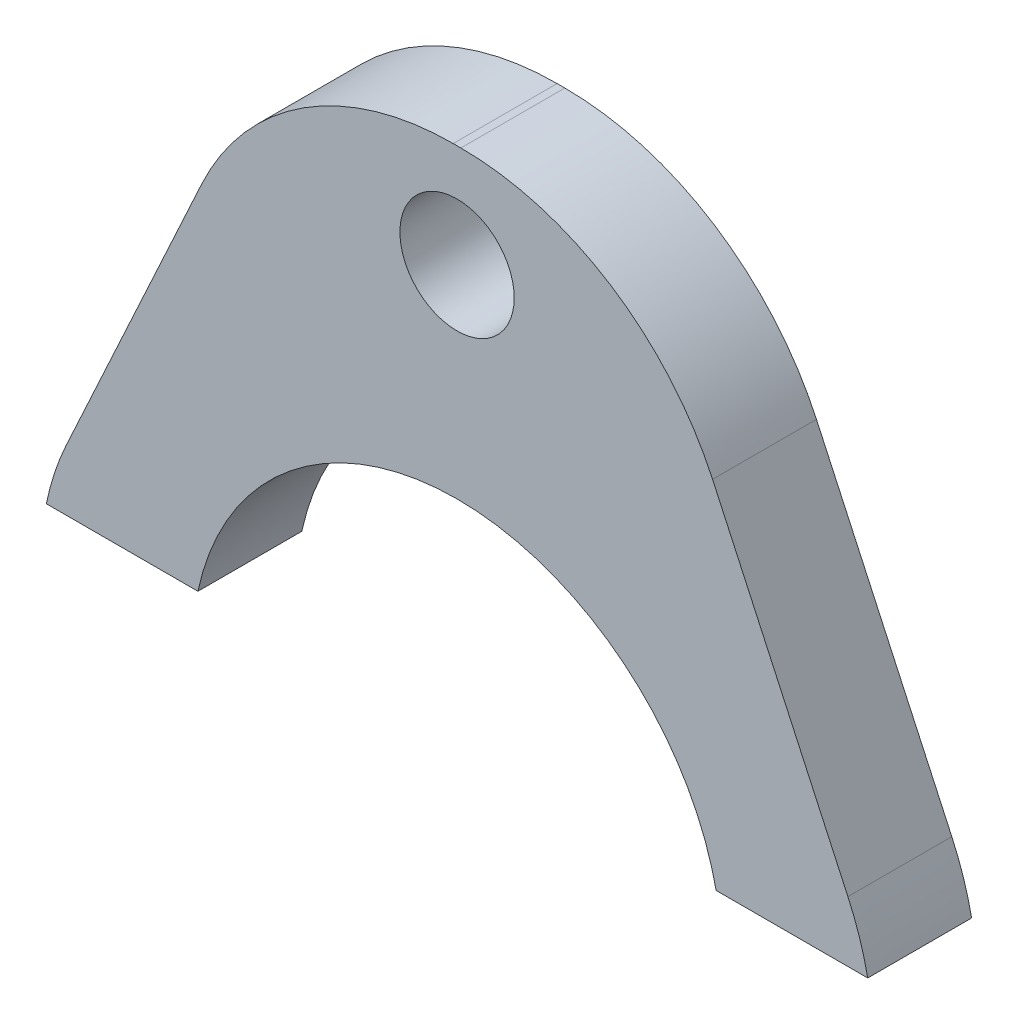
ISO-10303-21;
HEADER;
FILE_DESCRIPTION(('STEP AP214'),'2;1');
FILE_NAME('part.step','',(''),(''),'','','');
FILE_SCHEMA(('AUTOMOTIVE_DESIGN { 1 0 10303 214 1 1 1 1 }'));
ENDSEC;
DATA;
#1=APPLICATION_CONTEXT('core data for automotive mechanical design processes');
#2=APPLICATION_PROTOCOL_DEFINITION('international standard','automotive_design',2000,#1);
#3=PRODUCT_CONTEXT('',#1,'mechanical');
#4=PRODUCT('Part','Part','',(#3));
#5=PRODUCT_RELATED_PRODUCT_CATEGORY('part','',(#4));
#6=PRODUCT_DEFINITION_FORMATION('','',#4);
#7=PRODUCT_DEFINITION_CONTEXT('part definition',#1,'design');
#8=PRODUCT_DEFINITION('design','',#6,#7);
#9=PRODUCT_DEFINITION_SHAPE('','',#8);
#10=(LENGTH_UNIT() NAMED_UNIT(*) SI_UNIT(.MILLI.,.METRE.));
#11=(NAMED_UNIT(*) PLANE_ANGLE_UNIT() SI_UNIT($,.RADIAN.));
#12=(NAMED_UNIT(*) SI_UNIT($,.STERADIAN.) SOLID_ANGLE_UNIT());
#13=UNCERTAINTY_MEASURE_WITH_UNIT(LENGTH_MEASURE(1.E-05),#10,'distance_accuracy_value','');
#14=(GEOMETRIC_REPRESENTATION_CONTEXT(3) GLOBAL_UNCERTAINTY_ASSIGNED_CONTEXT((#13)) GLOBAL_UNIT_ASSIGNED_CONTEXT((#10,
#11,#12)) REPRESENTATION_CONTEXT('',''));
#15=CARTESIAN_POINT('',(0.,0.,0.));
#16=DIRECTION('',(0.,0.,1.));
#17=DIRECTION('',(1.,0.,0.));
#18=AXIS2_PLACEMENT_3D('',#15,#16,#17);
#19=CARTESIAN_POINT('',(-10.580626268283,4.87574074074075,3.));
#20=DIRECTION('',(-0.908208263371934,0.418518518518519,0.));
#21=DIRECTION('',(-0.418518518518519,-0.908208263371934,0.));
#22=AXIS2_PLACEMENT_3D('',#19,#20,#21);
#23=PLANE('',#22);
#24=DIRECTION('',(0.418518518518519,0.908208263371934,0.));
#25=VECTOR('',#24,1.);
#26=CARTESIAN_POINT('',(-10.580626268283,4.87574074074075,3.));
#27=LINE('',#26,#25);
#28=CARTESIAN_POINT('',(-11.2845681002788,3.34814814814815,3.));
#29=VERTEX_POINT('',#28);
#30=CARTESIAN_POINT('',(-7.37683329960606,11.8281481481482,3.));
#31=VERTEX_POINT('',#30);
#32=EDGE_CURVE('E119',#29,#31,#27,.T.);
#33=ORIENTED_EDGE('',*,*,#32,.T.);
#34=DIRECTION('',(0.,0.,-1.));
#35=VECTOR('',#34,1.);
#36=CARTESIAN_POINT('',(-7.37683329960606,11.8281481481482,3.));
#37=LINE('',#36,#35);
#38=CARTESIAN_POINT('',(-7.37683329960606,11.8281481481482,0.));
#39=VERTEX_POINT('',#38);
#40=EDGE_CURVE('E126',#31,#39,#37,.T.);
#41=ORIENTED_EDGE('',*,*,#40,.T.);
#42=DIRECTION('',(0.418518518518519,0.908208263371934,0.));
#43=VECTOR('',#42,1.);
#44=CARTESIAN_POINT('',(-10.580626268283,4.87574074074075,0.));
#45=LINE('',#44,#43);
#46=CARTESIAN_POINT('',(-11.2845681002788,3.34814814814815,0.));
#47=VERTEX_POINT('',#46);
#48=EDGE_CURVE('E122',#47,#39,#45,.T.);
#49=ORIENTED_EDGE('',*,*,#48,.F.);
#50=DIRECTION('',(0.,0.,-1.));
#51=VECTOR('',#50,1.);
#52=CARTESIAN_POINT('',(-11.2845681002788,3.34814814814815,3.));
#53=LINE('',#52,#51);
#54=EDGE_CURVE('E115',#29,#47,#53,.T.);
#55=ORIENTED_EDGE('',*,*,#54,.F.);
#56=EDGE_LOOP('',(#33,#41,#49,#55));
#57=FACE_BOUND('',#56,.T.);
#58=ADVANCED_FACE('F37',(#57),#23,.T.);
#59=CARTESIAN_POINT('',(-4.01890199330331,0.,3.));
#60=DIRECTION('',(0.,0.,-1.));
#61=DIRECTION('',(-1.,0.,0.));
#62=AXIS2_PLACEMENT_3D('',#59,#60,#61);
#63=CYLINDRICAL_SURFACE('',#62,8.);
#64=CARTESIAN_POINT('',(-4.01890199330331,0.,0.));
#65=DIRECTION('',(0.,0.,1.));
#66=DIRECTION('',(1.,0.,0.));
#67=AXIS2_PLACEMENT_3D('',#64,#65,#66);
#68=CIRCLE('',#67,8.);
#69=CARTESIAN_POINT('',(-11.8572691702095,1.6,0.));
#70=VERTEX_POINT('',#69);
#71=EDGE_CURVE('E161',#47,#70,#68,.T.);
#72=ORIENTED_EDGE('',*,*,#71,.T.);
#73=DIRECTION('',(0.,0.,-1.));
#74=VECTOR('',#73,1.);
#75=CARTESIAN_POINT('',(-11.8572691702095,1.6,3.));
#76=LINE('',#75,#74);
#77=CARTESIAN_POINT('',(-11.8572691702095,1.6,3.));
#78=VERTEX_POINT('',#77);
#79=EDGE_CURVE('E127',#78,#70,#76,.T.);
#80=ORIENTED_EDGE('',*,*,#79,.F.);
#81=CARTESIAN_POINT('',(-4.01890199330331,0.,3.));
#82=DIRECTION('',(0.,0.,1.));
#83=DIRECTION('',(1.,0.,0.));
#84=AXIS2_PLACEMENT_3D('',#81,#82,#83);
#85=CIRCLE('',#84,8.);
#86=EDGE_CURVE('E131',#29,#78,#85,.T.);
#87=ORIENTED_EDGE('',*,*,#86,.F.);
#88=ORIENTED_EDGE('',*,*,#54,.T.);
#89=EDGE_LOOP('',(#72,#80,#87,#88));
#90=FACE_BOUND('',#89,.T.);
#91=ADVANCED_FACE('F132',(#90),#63,.T.);
#92=CARTESIAN_POINT('',(0.,1.6,3.));
#93=DIRECTION('',(0.,1.,0.));
#94=DIRECTION('',(0.,0.,1.));
#95=AXIS2_PLACEMENT_3D('',#92,#93,#94);
#96=PLANE('',#95);
#97=DIRECTION('',(1.,0.,0.));
#98=VECTOR('',#97,1.);
#99=CARTESIAN_POINT('',(0.,1.6,0.));
#100=LINE('',#99,#98);
#101=CARTESIAN_POINT('',(-7.48080877980449,1.6,0.));
#102=VERTEX_POINT('',#101);
#103=EDGE_CURVE('E163',#70,#102,#100,.T.);
#104=ORIENTED_EDGE('',*,*,#103,.T.);
#105=DIRECTION('',(0.,0.,-1.));
#106=VECTOR('',#105,1.);
#107=CARTESIAN_POINT('',(-7.48080877980449,1.6,3.));
#108=LINE('',#107,#106);
#109=CARTESIAN_POINT('',(-7.48080877980449,1.6,3.));
#110=VERTEX_POINT('',#109);
#111=EDGE_CURVE('E182',#110,#102,#108,.T.);
#112=ORIENTED_EDGE('',*,*,#111,.F.);
#113=DIRECTION('',(1.,0.,0.));
#114=VECTOR('',#113,1.);
#115=CARTESIAN_POINT('',(0.,1.6,3.));
#116=LINE('',#115,#114);
#117=EDGE_CURVE('E134',#78,#110,#116,.T.);
#118=ORIENTED_EDGE('',*,*,#117,.F.);
#119=ORIENTED_EDGE('',*,*,#79,.T.);
#120=EDGE_LOOP('',(#104,#112,#118,#119));
#121=FACE_BOUND('',#120,.T.);
#122=ADVANCED_FACE('F208',(#121),#96,.F.);
#123=CARTESIAN_POINT('',(0.,0.,3.));
#124=DIRECTION('',(0.,0.,-1.));
#125=DIRECTION('',(-1.,0.,0.));
#126=AXIS2_PLACEMENT_3D('',#123,#124,#125);
#127=CYLINDRICAL_SURFACE('',#126,7.65);
#128=CARTESIAN_POINT('',(0.,0.,0.));
#129=DIRECTION('',(0.,0.,1.));
#130=DIRECTION('',(1.,0.,0.));
#131=AXIS2_PLACEMENT_3D('',#128,#129,#130);
#132=CIRCLE('',#131,7.65);
#133=CARTESIAN_POINT('',(7.48080877980449,1.6,0.));
#134=VERTEX_POINT('',#133);
#135=EDGE_CURVE('E166',#134,#102,#132,.T.);
#136=ORIENTED_EDGE('',*,*,#135,.F.);
#137=DIRECTION('',(0.,0.,-1.));
#138=VECTOR('',#137,1.);
#139=CARTESIAN_POINT('',(7.48080877980449,1.6,3.));
#140=LINE('',#139,#138);
#141=CARTESIAN_POINT('',(7.48080877980449,1.6,3.));
#142=VERTEX_POINT('',#141);
#143=EDGE_CURVE('E180',#142,#134,#140,.T.);
#144=ORIENTED_EDGE('',*,*,#143,.F.);
#145=CARTESIAN_POINT('',(0.,0.,3.));
#146=DIRECTION('',(0.,0.,1.));
#147=DIRECTION('',(1.,0.,0.));
#148=AXIS2_PLACEMENT_3D('',#145,#146,#147);
#149=CIRCLE('',#148,7.65);
#150=EDGE_CURVE('E145',#142,#110,#149,.T.);
#151=ORIENTED_EDGE('',*,*,#150,.T.);
#152=ORIENTED_EDGE('',*,*,#111,.T.);
#153=EDGE_LOOP('',(#136,#144,#151,#152));
#154=FACE_BOUND('',#153,.T.);
#155=ADVANCED_FACE('F214',(#154),#127,.F.);
#156=CARTESIAN_POINT('',(11.8572691702095,1.6,0.));
#157=VERTEX_POINT('',#156);
#158=EDGE_CURVE('E167',#134,#157,#100,.T.);
#159=ORIENTED_EDGE('',*,*,#158,.T.);
#160=DIRECTION('',(0.,0.,-1.));
#161=VECTOR('',#160,1.);
#162=CARTESIAN_POINT('',(11.8572691702095,1.6,3.));
#163=LINE('',#162,#161);
#164=CARTESIAN_POINT('',(11.8572691702095,1.6,3.));
#165=VERTEX_POINT('',#164);
#166=EDGE_CURVE('E178',#165,#157,#163,.T.);
#167=ORIENTED_EDGE('',*,*,#166,.F.);
#168=EDGE_CURVE('E146',#142,#165,#116,.T.);
#169=ORIENTED_EDGE('',*,*,#168,.F.);
#170=ORIENTED_EDGE('',*,*,#143,.T.);
#171=EDGE_LOOP('',(#159,#167,#169,#170));
#172=FACE_BOUND('',#171,.T.);
#173=ADVANCED_FACE('F217',(#172),#96,.F.);
#174=CARTESIAN_POINT('',(4.01890199330331,0.,3.));
#175=DIRECTION('',(0.,0.,-1.));
#176=DIRECTION('',(-1.,0.,0.));
#177=AXIS2_PLACEMENT_3D('',#174,#175,#176);
#178=CYLINDRICAL_SURFACE('',#177,8.);
#179=CARTESIAN_POINT('',(4.01890199330331,0.,0.));
#180=DIRECTION('',(0.,0.,1.));
#181=DIRECTION('',(1.,0.,0.));
#182=AXIS2_PLACEMENT_3D('',#179,#180,#181);
#183=CIRCLE('',#182,8.);
#184=CARTESIAN_POINT('',(11.2845681002788,3.34814814814815,0.));
#185=VERTEX_POINT('',#184);
#186=EDGE_CURVE('E170',#185,#157,#183,.F.);
#187=ORIENTED_EDGE('',*,*,#186,.F.);
#188=DIRECTION('',(0.,0.,-1.));
#189=VECTOR('',#188,1.);
#190=CARTESIAN_POINT('',(11.2845681002788,3.34814814814815,3.));
#191=LINE('',#190,#189);
#192=CARTESIAN_POINT('',(11.2845681002788,3.34814814814815,3.));
#193=VERTEX_POINT('',#192);
#194=EDGE_CURVE('E156',#193,#185,#191,.T.);
#195=ORIENTED_EDGE('',*,*,#194,.F.);
#196=CARTESIAN_POINT('',(4.01890199330331,0.,3.));
#197=DIRECTION('',(0.,0.,1.));
#198=DIRECTION('',(1.,0.,0.));
#199=AXIS2_PLACEMENT_3D('',#196,#197,#198);
#200=CIRCLE('',#199,8.);
#201=EDGE_CURVE('E149',#193,#165,#200,.F.);
#202=ORIENTED_EDGE('',*,*,#201,.T.);
#203=ORIENTED_EDGE('',*,*,#166,.T.);
#204=EDGE_LOOP('',(#187,#195,#202,#203));
#205=FACE_BOUND('',#204,.T.);
#206=ADVANCED_FACE('F220',(#205),#178,.T.);
#207=CARTESIAN_POINT('',(10.580626268283,4.87574074074075,3.));
#208=DIRECTION('',(-0.908208263371934,-0.418518518518519,0.));
#209=DIRECTION('',(0.418518518518519,-0.908208263371934,0.));
#210=AXIS2_PLACEMENT_3D('',#207,#208,#209);
#211=PLANE('',#210);
#212=DIRECTION('',(-0.418518518518519,0.908208263371934,0.));
#213=VECTOR('',#212,1.);
#214=CARTESIAN_POINT('',(10.580626268283,4.87574074074075,0.));
#215=LINE('',#214,#213);
#216=CARTESIAN_POINT('',(7.37683329960606,11.8281481481482,0.));
#217=VERTEX_POINT('',#216);
#218=EDGE_CURVE('E173',#185,#217,#215,.T.);
#219=ORIENTED_EDGE('',*,*,#218,.T.);
#220=DIRECTION('',(0.,0.,-1.));
#221=VECTOR('',#220,1.);
#222=CARTESIAN_POINT('',(7.37683329960606,11.8281481481482,3.));
#223=LINE('',#222,#221);
#224=CARTESIAN_POINT('',(7.37683329960606,11.8281481481482,3.));
#225=VERTEX_POINT('',#224);
#226=EDGE_CURVE('E11',#217,#225,#223,.F.);
#227=ORIENTED_EDGE('',*,*,#226,.T.);
#228=DIRECTION('',(-0.418518518518519,0.908208263371934,0.));
#229=VECTOR('',#228,1.);
#230=CARTESIAN_POINT('',(10.580626268283,4.87574074074075,3.));
#231=LINE('',#230,#229);
#232=EDGE_CURVE('E152',#193,#225,#231,.T.);
#233=ORIENTED_EDGE('',*,*,#232,.F.);
#234=ORIENTED_EDGE('',*,*,#194,.T.);
#235=EDGE_LOOP('',(#219,#227,#233,#234));
#236=FACE_BOUND('',#235,.T.);
#237=ADVANCED_FACE('F223',(#236),#211,.F.);
#238=CARTESIAN_POINT('',(0.,13.5,3.));
#239=DIRECTION('',(0.,0.,-1.));
#240=DIRECTION('',(-1.,0.,0.));
#241=AXIS2_PLACEMENT_3D('',#238,#239,#240);
#242=CYLINDRICAL_SURFACE('',#241,1.65);
#243=CARTESIAN_POINT('',(0.,13.5,3.));
#244=DIRECTION('',(0.,0.,1.));
#245=DIRECTION('',(1.,0.,0.));
#246=AXIS2_PLACEMENT_3D('',#243,#244,#245);
#247=CIRCLE('',#246,1.65);
#248=CARTESIAN_POINT('',(1.65,13.5,3.));
#249=VERTEX_POINT('',#248);
#250=EDGE_CURVE('E138',#249,#249,#247,.T.);
#251=ORIENTED_EDGE('',*,*,#250,.T.);
#252=EDGE_LOOP('',(#251));
#253=FACE_BOUND('',#252,.T.);
#254=CARTESIAN_POINT('',(0.,13.5,0.));
#255=DIRECTION('',(0.,0.,1.));
#256=DIRECTION('',(1.,0.,0.));
#257=AXIS2_PLACEMENT_3D('',#254,#255,#256);
#258=CIRCLE('',#257,1.65);
#259=CARTESIAN_POINT('',(1.65,13.5,0.));
#260=VERTEX_POINT('',#259);
#261=EDGE_CURVE('E157',#260,#260,#258,.T.);
#262=ORIENTED_EDGE('',*,*,#261,.F.);
#263=EDGE_LOOP('',(#262));
#264=FACE_BOUND('',#263,.T.);
#265=ADVANCED_FACE('F225',(#253,#264),#242,.F.);
#266=CARTESIAN_POINT('',(0.,16.48,3.));
#267=DIRECTION('',(0.,1.,0.));
#268=DIRECTION('',(0.,0.,1.));
#269=AXIS2_PLACEMENT_3D('',#266,#267,#268);
#270=PLANE('',#269);
#271=DIRECTION('',(1.,0.,0.));
#272=VECTOR('',#271,1.);
#273=CARTESIAN_POINT('',(0.,16.48,0.));
#274=LINE('',#273,#272);
#275=CARTESIAN_POINT('',(-0.111167192630593,16.48,0.));
#276=VERTEX_POINT('',#275);
#277=CARTESIAN_POINT('',(0.111167192630593,16.48,0.));
#278=VERTEX_POINT('',#277);
#279=EDGE_CURVE('E141',#276,#278,#274,.T.);
#280=ORIENTED_EDGE('',*,*,#279,.F.);
#281=DIRECTION('',(0.,0.,-1.));
#282=VECTOR('',#281,1.);
#283=CARTESIAN_POINT('',(-0.111167192630593,16.48,3.));
#284=LINE('',#283,#282);
#285=CARTESIAN_POINT('',(-0.111167192630593,16.48,3.));
#286=VERTEX_POINT('',#285);
#287=EDGE_CURVE('E193',#276,#286,#284,.F.);
#288=ORIENTED_EDGE('',*,*,#287,.T.);
#289=DIRECTION('',(1.,0.,0.));
#290=VECTOR('',#289,1.);
#291=CARTESIAN_POINT('',(0.,16.48,3.));
#292=LINE('',#291,#290);
#293=CARTESIAN_POINT('',(0.111167192630593,16.48,3.));
#294=VERTEX_POINT('',#293);
#295=EDGE_CURVE('E154',#286,#294,#292,.T.);
#296=ORIENTED_EDGE('',*,*,#295,.T.);
#297=DIRECTION('',(0.,0.,-1.));
#298=VECTOR('',#297,1.);
#299=CARTESIAN_POINT('',(0.111167192630593,16.48,0.));
#300=LINE('',#299,#298);
#301=EDGE_CURVE('E190',#294,#278,#300,.T.);
#302=ORIENTED_EDGE('',*,*,#301,.T.);
#303=EDGE_LOOP('',(#280,#288,#296,#302));
#304=FACE_BOUND('',#303,.T.);
#305=ADVANCED_FACE('F198',(#304),#270,.T.);
#306=CARTESIAN_POINT('',(0.,0.,3.));
#307=DIRECTION('',(0.,0.,1.));
#308=DIRECTION('',(1.,0.,0.));
#309=AXIS2_PLACEMENT_3D('',#306,#307,#308);
#310=PLANE('',#309);
#311=ORIENTED_EDGE('',*,*,#250,.F.);
#312=EDGE_LOOP('',(#311));
#313=FACE_BOUND('',#312,.T.);
#314=ORIENTED_EDGE('',*,*,#295,.F.);
#315=CARTESIAN_POINT('',(-0.111167192630593,8.48,3.));
#316=DIRECTION('',(0.,0.,1.));
#317=DIRECTION('',(1.,0.,0.));
#318=AXIS2_PLACEMENT_3D('',#315,#316,#317);
#319=CIRCLE('',#318,8.);
#320=EDGE_CURVE('E45',#286,#31,#319,.T.);
#321=ORIENTED_EDGE('',*,*,#320,.T.);
#322=ORIENTED_EDGE('',*,*,#32,.F.);
#323=ORIENTED_EDGE('',*,*,#86,.T.);
#324=ORIENTED_EDGE('',*,*,#117,.T.);
#325=ORIENTED_EDGE('',*,*,#150,.F.);
#326=ORIENTED_EDGE('',*,*,#168,.T.);
#327=ORIENTED_EDGE('',*,*,#201,.F.);
#328=ORIENTED_EDGE('',*,*,#232,.T.);
#329=CARTESIAN_POINT('',(0.111167192630593,8.48,3.));
#330=DIRECTION('',(0.,0.,1.));
#331=DIRECTION('',(1.,0.,0.));
#332=AXIS2_PLACEMENT_3D('',#329,#330,#331);
#333=CIRCLE('',#332,8.);
#334=EDGE_CURVE('E57',#225,#294,#333,.T.);
#335=ORIENTED_EDGE('',*,*,#334,.T.);
#336=EDGE_LOOP('',(#314,#321,#322,#323,#324,#325,#326,#327,#328,#335));
#337=FACE_BOUND('',#336,.T.);
#338=ADVANCED_FACE('F136',(#313,#337),#310,.T.);
#339=CARTESIAN_POINT('',(0.,0.,0.));
#340=DIRECTION('',(0.,0.,1.));
#341=DIRECTION('',(1.,0.,0.));
#342=AXIS2_PLACEMENT_3D('',#339,#340,#341);
#343=PLANE('',#342);
#344=ORIENTED_EDGE('',*,*,#261,.T.);
#345=EDGE_LOOP('',(#344));
#346=FACE_BOUND('',#345,.T.);
#347=ORIENTED_EDGE('',*,*,#48,.T.);
#348=CARTESIAN_POINT('',(-0.111167192630593,8.48,0.));
#349=DIRECTION('',(0.,0.,1.));
#350=DIRECTION('',(1.,0.,0.));
#351=AXIS2_PLACEMENT_3D('',#348,#349,#350);
#352=CIRCLE('',#351,8.);
#353=EDGE_CURVE('E188',#39,#276,#352,.F.);
#354=ORIENTED_EDGE('',*,*,#353,.T.);
#355=ORIENTED_EDGE('',*,*,#279,.T.);
#356=CARTESIAN_POINT('',(0.111167192630593,8.48,0.));
#357=DIRECTION('',(0.,0.,1.));
#358=DIRECTION('',(1.,0.,0.));
#359=AXIS2_PLACEMENT_3D('',#356,#357,#358);
#360=CIRCLE('',#359,8.);
#361=EDGE_CURVE('E186',#278,#217,#360,.F.);
#362=ORIENTED_EDGE('',*,*,#361,.T.);
#363=ORIENTED_EDGE('',*,*,#218,.F.);
#364=ORIENTED_EDGE('',*,*,#186,.T.);
#365=ORIENTED_EDGE('',*,*,#158,.F.);
#366=ORIENTED_EDGE('',*,*,#135,.T.);
#367=ORIENTED_EDGE('',*,*,#103,.F.);
#368=ORIENTED_EDGE('',*,*,#71,.F.);
#369=EDGE_LOOP('',(#347,#354,#355,#362,#363,#364,#365,#366,#367,#368));
#370=FACE_BOUND('',#369,.T.);
#371=ADVANCED_FACE('F203',(#346,#370),#343,.F.);
#372=CARTESIAN_POINT('',(-0.111167192630593,8.48,3.));
#373=DIRECTION('',(0.,0.,-1.));
#374=DIRECTION('',(-1.,0.,0.));
#375=AXIS2_PLACEMENT_3D('',#372,#373,#374);
#376=CYLINDRICAL_SURFACE('',#375,8.);
#377=ORIENTED_EDGE('',*,*,#320,.F.);
#378=ORIENTED_EDGE('',*,*,#287,.F.);
#379=ORIENTED_EDGE('',*,*,#353,.F.);
#380=ORIENTED_EDGE('',*,*,#40,.F.);
#381=EDGE_LOOP('',(#377,#378,#379,#380));
#382=FACE_BOUND('',#381,.T.);
#383=ADVANCED_FACE('F201',(#382),#376,.T.);
#384=CARTESIAN_POINT('',(0.111167192630593,8.48,3.));
#385=DIRECTION('',(0.,0.,1.));
#386=DIRECTION('',(1.,0.,0.));
#387=AXIS2_PLACEMENT_3D('',#384,#385,#386);
#388=CYLINDRICAL_SURFACE('',#387,8.);
#389=ORIENTED_EDGE('',*,*,#334,.F.);
#390=ORIENTED_EDGE('',*,*,#226,.F.);
#391=ORIENTED_EDGE('',*,*,#361,.F.);
#392=ORIENTED_EDGE('',*,*,#301,.F.);
#393=EDGE_LOOP('',(#389,#390,#391,#392));
#394=FACE_BOUND('',#393,.T.);
#395=ADVANCED_FACE('F39',(#394),#388,.T.);
#396=CLOSED_SHELL('',(#58,#91,#122,#155,#173,#206,#237,#265,#305,#338,#371,#383,#395));
#397=MANIFOLD_SOLID_BREP('B2',#396);
#398=ADVANCED_BREP_SHAPE_REPRESENTATION('',(#18,#397),#14);
#399=SHAPE_DEFINITION_REPRESENTATION(#9,#398);
ENDSEC;
END-ISO-10303-21;
